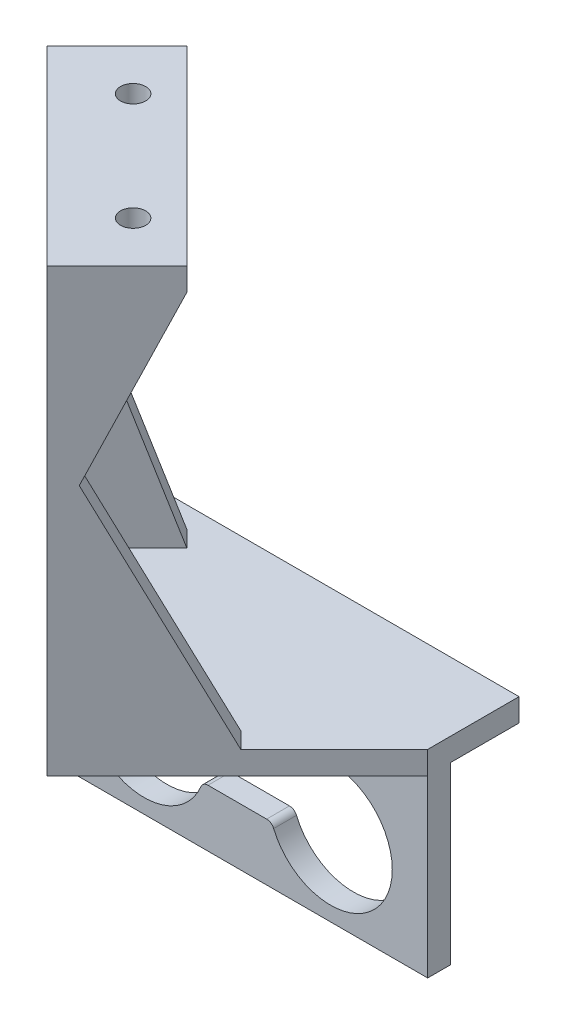
ISO-10303-21;
HEADER;
FILE_DESCRIPTION(('STEP AP214'),'2;1');
FILE_NAME('part.step','',(''),(''),'','','');
FILE_SCHEMA(('AUTOMOTIVE_DESIGN { 1 0 10303 214 1 1 1 1 }'));
ENDSEC;
DATA;
#1=APPLICATION_CONTEXT('core data for automotive mechanical design processes');
#2=APPLICATION_PROTOCOL_DEFINITION('international standard','automotive_design',2000,#1);
#3=PRODUCT_CONTEXT('',#1,'mechanical');
#4=PRODUCT('Part','Part','',(#3));
#5=PRODUCT_RELATED_PRODUCT_CATEGORY('part','',(#4));
#6=PRODUCT_DEFINITION_FORMATION('','',#4);
#7=PRODUCT_DEFINITION_CONTEXT('part definition',#1,'design');
#8=PRODUCT_DEFINITION('design','',#6,#7);
#9=PRODUCT_DEFINITION_SHAPE('','',#8);
#10=(LENGTH_UNIT() NAMED_UNIT(*) SI_UNIT(.MILLI.,.METRE.));
#11=(NAMED_UNIT(*) PLANE_ANGLE_UNIT() SI_UNIT($,.RADIAN.));
#12=(NAMED_UNIT(*) SI_UNIT($,.STERADIAN.) SOLID_ANGLE_UNIT());
#13=UNCERTAINTY_MEASURE_WITH_UNIT(LENGTH_MEASURE(1.E-05),#10,'distance_accuracy_value','');
#14=(GEOMETRIC_REPRESENTATION_CONTEXT(3) GLOBAL_UNCERTAINTY_ASSIGNED_CONTEXT((#13)) GLOBAL_UNIT_ASSIGNED_CONTEXT((#10,
#11,#12)) REPRESENTATION_CONTEXT('',''));
#15=CARTESIAN_POINT('',(0.,0.,0.));
#16=DIRECTION('',(0.,0.,1.));
#17=DIRECTION('',(1.,0.,0.));
#18=AXIS2_PLACEMENT_3D('',#15,#16,#17);
#19=CARTESIAN_POINT('',(2.12132034355976,71.,22.8786796564402));
#20=DIRECTION('',(0.707106781186548,0.,-0.707106781186547));
#21=DIRECTION('',(0.707106781186547,0.,0.707106781186548));
#22=AXIS2_PLACEMENT_3D('',#19,#20,#21);
#23=PLANE('',#22);
#24=DIRECTION('',(0.707106781186547,0.,0.707106781186548));
#25=VECTOR('',#24,1.);
#26=CARTESIAN_POINT('',(1.23165366794353E-13,68.,20.7573593128806));
#27=LINE('',#26,#25);
#28=CARTESIAN_POINT('',(-20.7573593128806,68.,-1.30537941567255E-13));
#29=VERTEX_POINT('',#28);
#30=CARTESIAN_POINT('',(1.22506171873482E-13,68.,20.7573593128806));
#31=VERTEX_POINT('',#30);
#32=EDGE_CURVE('E261',#29,#31,#27,.T.);
#33=ORIENTED_EDGE('',*,*,#32,.T.);
#34=DIRECTION('',(0.,-1.,0.));
#35=VECTOR('',#34,1.);
#36=CARTESIAN_POINT('',(0.,0.,20.7573593128805));
#37=LINE('',#36,#35);
#38=CARTESIAN_POINT('',(0.,46.,20.7573593128805));
#39=VERTEX_POINT('',#38);
#40=EDGE_CURVE('E505',#31,#39,#37,.T.);
#41=ORIENTED_EDGE('',*,*,#40,.T.);
#42=DIRECTION('',(0.,-1.,0.));
#43=VECTOR('',#42,1.);
#44=CARTESIAN_POINT('',(0.,0.,20.7573593128805));
#45=LINE('',#44,#43);
#46=CARTESIAN_POINT('',(0.,16.,20.7573593128805));
#47=VERTEX_POINT('',#46);
#48=EDGE_CURVE('E510',#39,#47,#45,.T.);
#49=ORIENTED_EDGE('',*,*,#48,.T.);
#50=DIRECTION('',(-0.707106781186547,0.,-0.707106781186548));
#51=VECTOR('',#50,1.);
#52=CARTESIAN_POINT('',(2.12132034355977,16.,22.8786796564402));
#53=LINE('',#52,#51);
#54=CARTESIAN_POINT('',(-20.7573593128806,16.,-1.27502175484295E-13));
#55=VERTEX_POINT('',#54);
#56=EDGE_CURVE('E269',#47,#55,#53,.T.);
#57=ORIENTED_EDGE('',*,*,#56,.T.);
#58=DIRECTION('',(0.,1.,0.));
#59=VECTOR('',#58,1.);
#60=CARTESIAN_POINT('',(-20.7573593128806,0.,-1.22731685925359E-13));
#61=LINE('',#60,#59);
#62=CARTESIAN_POINT('',(-20.7573593128806,46.,-1.24032728532342E-13));
#63=VERTEX_POINT('',#62);
#64=EDGE_CURVE('E491',#55,#63,#61,.T.);
#65=ORIENTED_EDGE('',*,*,#64,.T.);
#66=DIRECTION('',(0.,1.,0.));
#67=VECTOR('',#66,1.);
#68=CARTESIAN_POINT('',(-20.7573593128806,0.,-1.22731685925359E-13));
#69=LINE('',#68,#67);
#70=EDGE_CURVE('E921',#63,#29,#69,.T.);
#71=ORIENTED_EDGE('',*,*,#70,.T.);
#72=EDGE_LOOP('',(#33,#41,#49,#57,#65,#71));
#73=FACE_BOUND('',#72,.T.);
#74=ADVANCED_FACE('F41',(#73),#23,.T.);
#75=CARTESIAN_POINT('',(7.0710678118656,68.,13.6862915010151));
#76=DIRECTION('',(0.,1.,0.));
#77=DIRECTION('',(-1.,0.,0.));
#78=AXIS2_PLACEMENT_3D('',#75,#76,#77);
#79=PLANE('',#78);
#80=CARTESIAN_POINT('',(0.227922061357971,68.,13.914213562373));
#81=DIRECTION('',(0.,1.,0.));
#82=DIRECTION('',(0.,0.,1.));
#83=AXIS2_PLACEMENT_3D('',#80,#81,#82);
#84=CIRCLE('',#83,1.65);
#85=CARTESIAN_POINT('',(0.227922061357971,68.,15.564213562373));
#86=VERTEX_POINT('',#85);
#87=EDGE_CURVE('E909',#86,#86,#84,.T.);
#88=ORIENTED_EDGE('',*,*,#87,.T.);
#89=EDGE_LOOP('',(#88));
#90=FACE_BOUND('',#89,.T.);
#91=CARTESIAN_POINT('',(-13.914213562373,68.,-0.227922061357981));
#92=DIRECTION('',(0.,1.,0.));
#93=DIRECTION('',(0.,0.,1.));
#94=AXIS2_PLACEMENT_3D('',#91,#92,#93);
#95=CIRCLE('',#94,1.65);
#96=CARTESIAN_POINT('',(-13.914213562373,68.,1.42207793864202));
#97=VERTEX_POINT('',#96);
#98=EDGE_CURVE('E915',#97,#97,#95,.T.);
#99=ORIENTED_EDGE('',*,*,#98,.T.);
#100=EDGE_LOOP('',(#99));
#101=FACE_BOUND('',#100,.T.);
#102=DIRECTION('',(0.707106781186549,0.,-0.707106781186547));
#103=VECTOR('',#102,1.);
#104=CARTESIAN_POINT('',(-10.3786796564403,68.,-10.3786796564404));
#105=LINE('',#104,#103);
#106=CARTESIAN_POINT('',(-13.6862915010151,68.,-7.0710678118656));
#107=VERTEX_POINT('',#106);
#108=EDGE_CURVE('E254',#29,#107,#105,.T.);
#109=ORIENTED_EDGE('',*,*,#108,.T.);
#110=DIRECTION('',(0.707106781186547,0.,0.707106781186548));
#111=VECTOR('',#110,1.);
#112=CARTESIAN_POINT('',(7.0710678118656,68.,13.6862915010151));
#113=LINE('',#112,#111);
#114=CARTESIAN_POINT('',(7.0710678118656,68.,13.6862915010151));
#115=VERTEX_POINT('',#114);
#116=EDGE_CURVE('E246',#107,#115,#113,.T.);
#117=ORIENTED_EDGE('',*,*,#116,.T.);
#118=DIRECTION('',(-0.707106781186548,0.,0.707106781186547));
#119=VECTOR('',#118,1.);
#120=CARTESIAN_POINT('',(7.0710678118656,68.,13.6862915010151));
#121=LINE('',#120,#119);
#122=EDGE_CURVE('E249',#115,#31,#121,.T.);
#123=ORIENTED_EDGE('',*,*,#122,.T.);
#124=ORIENTED_EDGE('',*,*,#32,.F.);
#125=EDGE_LOOP('',(#109,#117,#123,#124));
#126=FACE_BOUND('',#125,.T.);
#127=ADVANCED_FACE('F544',(#90,#101,#126),#79,.F.);
#128=CARTESIAN_POINT('',(0.,16.,0.));
#129=DIRECTION('',(0.,1.,0.));
#130=DIRECTION('',(-1.,0.,0.));
#131=AXIS2_PLACEMENT_3D('',#128,#129,#130);
#132=PLANE('',#131);
#133=ORIENTED_EDGE('',*,*,#56,.F.);
#134=DIRECTION('',(0.707106781186551,0.,-0.707106781186544));
#135=VECTOR('',#134,1.);
#136=CARTESIAN_POINT('',(10.3786796564402,16.,10.3786796564403));
#137=LINE('',#136,#135);
#138=CARTESIAN_POINT('',(10.6066017177983,16.,10.1507575950823));
#139=VERTEX_POINT('',#138);
#140=EDGE_CURVE('E515',#47,#139,#137,.T.);
#141=ORIENTED_EDGE('',*,*,#140,.T.);
#142=DIRECTION('',(0.707106781186544,0.,0.707106781186551));
#143=VECTOR('',#142,1.);
#144=CARTESIAN_POINT('',(10.6066017177983,16.,10.1507575950823));
#145=LINE('',#144,#143);
#146=CARTESIAN_POINT('',(12.7279220613579,16.,12.272077938642));
#147=VERTEX_POINT('',#146);
#148=EDGE_CURVE('E267',#139,#147,#145,.T.);
#149=ORIENTED_EDGE('',*,*,#148,.T.);
#150=DIRECTION('',(-0.707106781186551,0.,0.707106781186544));
#151=VECTOR('',#150,1.);
#152=CARTESIAN_POINT('',(25.,16.,0.));
#153=LINE('',#152,#151);
#154=CARTESIAN_POINT('',(25.,16.,0.));
#155=VERTEX_POINT('',#154);
#156=EDGE_CURVE('E284',#155,#147,#153,.T.);
#157=ORIENTED_EDGE('',*,*,#156,.F.);
#158=DIRECTION('',(0.,0.,1.));
#159=VECTOR('',#158,1.);
#160=CARTESIAN_POINT('',(25.,16.,0.));
#161=LINE('',#160,#159);
#162=CARTESIAN_POINT('',(25.,16.,-12.));
#163=VERTEX_POINT('',#162);
#164=EDGE_CURVE('E315',#163,#155,#161,.T.);
#165=ORIENTED_EDGE('',*,*,#164,.F.);
#166=DIRECTION('',(1.,0.,0.));
#167=VECTOR('',#166,1.);
#168=CARTESIAN_POINT('',(-25.,16.,-12.));
#169=LINE('',#168,#167);
#170=CARTESIAN_POINT('',(-25.,16.,-12.));
#171=VERTEX_POINT('',#170);
#172=EDGE_CURVE('E312',#171,#163,#169,.T.);
#173=ORIENTED_EDGE('',*,*,#172,.F.);
#174=DIRECTION('',(0.,0.,-1.));
#175=VECTOR('',#174,1.);
#176=CARTESIAN_POINT('',(-25.,16.,0.));
#177=LINE('',#176,#175);
#178=CARTESIAN_POINT('',(-25.,16.,0.));
#179=VERTEX_POINT('',#178);
#180=EDGE_CURVE('E309',#179,#171,#177,.T.);
#181=ORIENTED_EDGE('',*,*,#180,.F.);
#182=DIRECTION('',(0.707106781186549,0.,-0.707106781186546));
#183=VECTOR('',#182,1.);
#184=CARTESIAN_POINT('',(-25.,16.,0.));
#185=LINE('',#184,#183);
#186=CARTESIAN_POINT('',(-15.8076118445747,16.,-9.19238815542524));
#187=VERTEX_POINT('',#186);
#188=EDGE_CURVE('E273',#179,#187,#185,.T.);
#189=ORIENTED_EDGE('',*,*,#188,.T.);
#190=DIRECTION('',(-0.707106781186546,0.,-0.707106781186548));
#191=VECTOR('',#190,1.);
#192=CARTESIAN_POINT('',(-13.6862915010151,16.,-7.07106781186559));
#193=LINE('',#192,#191);
#194=CARTESIAN_POINT('',(-13.6862915010151,16.,-7.0710678118656));
#195=VERTEX_POINT('',#194);
#196=EDGE_CURVE('E488',#195,#187,#193,.T.);
#197=ORIENTED_EDGE('',*,*,#196,.F.);
#198=DIRECTION('',(0.707106781186549,0.,-0.707106781186547));
#199=VECTOR('',#198,1.);
#200=CARTESIAN_POINT('',(-10.3786796564403,16.,-10.3786796564404));
#201=LINE('',#200,#199);
#202=EDGE_CURVE('E489',#55,#195,#201,.T.);
#203=ORIENTED_EDGE('',*,*,#202,.F.);
#204=EDGE_LOOP('',(#133,#141,#149,#157,#165,#173,#181,#189,#197,#203));
#205=FACE_BOUND('',#204,.T.);
#206=ADVANCED_FACE('F470',(#205),#132,.T.);
#207=CARTESIAN_POINT('',(-25.,16.,-12.));
#208=DIRECTION('',(0.,0.,1.));
#209=DIRECTION('',(-1.,0.,0.));
#210=AXIS2_PLACEMENT_3D('',#207,#208,#209);
#211=PLANE('',#210);
#212=DIRECTION('',(-1.,0.,0.));
#213=VECTOR('',#212,1.);
#214=CARTESIAN_POINT('',(25.,13.,-12.));
#215=LINE('',#214,#213);
#216=CARTESIAN_POINT('',(25.,13.,-12.));
#217=VERTEX_POINT('',#216);
#218=CARTESIAN_POINT('',(-25.,13.,-12.));
#219=VERTEX_POINT('',#218);
#220=EDGE_CURVE('E301',#217,#219,#215,.T.);
#221=ORIENTED_EDGE('',*,*,#220,.T.);
#222=DIRECTION('',(0.,-1.,0.));
#223=VECTOR('',#222,1.);
#224=CARTESIAN_POINT('',(-25.,16.,-12.));
#225=LINE('',#224,#223);
#226=EDGE_CURVE('E321',#171,#219,#225,.T.);
#227=ORIENTED_EDGE('',*,*,#226,.F.);
#228=ORIENTED_EDGE('',*,*,#172,.T.);
#229=DIRECTION('',(0.,-1.,0.));
#230=VECTOR('',#229,1.);
#231=CARTESIAN_POINT('',(25.,16.,-12.));
#232=LINE('',#231,#230);
#233=EDGE_CURVE('E318',#163,#217,#232,.T.);
#234=ORIENTED_EDGE('',*,*,#233,.T.);
#235=EDGE_LOOP('',(#221,#227,#228,#234));
#236=FACE_BOUND('',#235,.T.);
#237=ADVANCED_FACE('F463',(#236),#211,.F.);
#238=CARTESIAN_POINT('',(0.,0.,-3.));
#239=DIRECTION('',(0.,0.,-1.));
#240=DIRECTION('',(1.,0.,0.));
#241=AXIS2_PLACEMENT_3D('',#238,#239,#240);
#242=PLANE('',#241);
#243=DIRECTION('',(0.,-1.,0.));
#244=VECTOR('',#243,1.);
#245=CARTESIAN_POINT('',(-25.,-10.,-3.));
#246=LINE('',#245,#244);
#247=CARTESIAN_POINT('',(-25.,13.,-3.));
#248=VERTEX_POINT('',#247);
#249=CARTESIAN_POINT('',(-25.,-10.,-3.));
#250=VERTEX_POINT('',#249);
#251=EDGE_CURVE('E421',#248,#250,#246,.T.);
#252=ORIENTED_EDGE('',*,*,#251,.F.);
#253=DIRECTION('',(1.,0.,0.));
#254=VECTOR('',#253,1.);
#255=CARTESIAN_POINT('',(25.,13.,-3.));
#256=LINE('',#255,#254);
#257=CARTESIAN_POINT('',(25.,13.,-3.));
#258=VERTEX_POINT('',#257);
#259=EDGE_CURVE('E306',#248,#258,#256,.T.);
#260=ORIENTED_EDGE('',*,*,#259,.T.);
#261=DIRECTION('',(0.,1.,0.));
#262=VECTOR('',#261,1.);
#263=CARTESIAN_POINT('',(25.,-10.,-3.));
#264=LINE('',#263,#262);
#265=CARTESIAN_POINT('',(25.,-10.,-3.));
#266=VERTEX_POINT('',#265);
#267=EDGE_CURVE('E428',#266,#258,#264,.T.);
#268=ORIENTED_EDGE('',*,*,#267,.F.);
#269=DIRECTION('',(1.,0.,0.));
#270=VECTOR('',#269,1.);
#271=CARTESIAN_POINT('',(25.,-10.,-3.));
#272=LINE('',#271,#270);
#273=EDGE_CURVE('E424',#250,#266,#272,.T.);
#274=ORIENTED_EDGE('',*,*,#273,.F.);
#275=EDGE_LOOP('',(#252,#260,#268,#274));
#276=FACE_BOUND('',#275,.T.);
#277=CARTESIAN_POINT('',(12.25,0.,-3.));
#278=DIRECTION('',(0.,0.,1.));
#279=DIRECTION('',(1.,0.,0.));
#280=AXIS2_PLACEMENT_3D('',#277,#278,#279);
#281=CIRCLE('',#280,8.1);
#282=CARTESIAN_POINT('',(4.77307692307692,-3.11538461538461,-3.));
#283=VERTEX_POINT('',#282);
#284=CARTESIAN_POINT('',(4.77307692307692,3.11538461538462,-3.));
#285=VERTEX_POINT('',#284);
#286=EDGE_CURVE('E360',#283,#285,#281,.T.);
#287=ORIENTED_EDGE('',*,*,#286,.T.);
#288=CARTESIAN_POINT('',(3.85,3.5,-3.));
#289=DIRECTION('',(0.,0.,-1.));
#290=DIRECTION('',(1.,0.,0.));
#291=AXIS2_PLACEMENT_3D('',#288,#289,#290);
#292=CIRCLE('',#291,1.);
#293=CARTESIAN_POINT('',(3.85,2.5,-3.));
#294=VERTEX_POINT('',#293);
#295=EDGE_CURVE('E364',#285,#294,#292,.T.);
#296=ORIENTED_EDGE('',*,*,#295,.T.);
#297=DIRECTION('',(-1.,0.,0.));
#298=VECTOR('',#297,1.);
#299=CARTESIAN_POINT('',(-3.85,2.5,-3.));
#300=LINE('',#299,#298);
#301=CARTESIAN_POINT('',(-3.85,2.5,-3.));
#302=VERTEX_POINT('',#301);
#303=EDGE_CURVE('E367',#294,#302,#300,.T.);
#304=ORIENTED_EDGE('',*,*,#303,.T.);
#305=CARTESIAN_POINT('',(-3.85,3.5,-3.));
#306=DIRECTION('',(0.,0.,-1.));
#307=DIRECTION('',(-1.,0.,0.));
#308=AXIS2_PLACEMENT_3D('',#305,#306,#307);
#309=CIRCLE('',#308,1.);
#310=CARTESIAN_POINT('',(-4.77307692307692,3.11538461538461,-3.));
#311=VERTEX_POINT('',#310);
#312=EDGE_CURVE('E370',#302,#311,#309,.T.);
#313=ORIENTED_EDGE('',*,*,#312,.T.);
#314=CARTESIAN_POINT('',(-12.25,0.,-3.));
#315=DIRECTION('',(0.,0.,1.));
#316=DIRECTION('',(1.,0.,0.));
#317=AXIS2_PLACEMENT_3D('',#314,#315,#316);
#318=CIRCLE('',#317,8.1);
#319=CARTESIAN_POINT('',(-4.77307692307692,-3.11538461538462,-3.));
#320=VERTEX_POINT('',#319);
#321=EDGE_CURVE('E373',#311,#320,#318,.T.);
#322=ORIENTED_EDGE('',*,*,#321,.T.);
#323=CARTESIAN_POINT('',(-3.85,-3.5,-3.));
#324=DIRECTION('',(0.,0.,-1.));
#325=DIRECTION('',(1.,0.,0.));
#326=AXIS2_PLACEMENT_3D('',#323,#324,#325);
#327=CIRCLE('',#326,1.);
#328=CARTESIAN_POINT('',(-3.85,-2.5,-3.));
#329=VERTEX_POINT('',#328);
#330=EDGE_CURVE('E376',#320,#329,#327,.T.);
#331=ORIENTED_EDGE('',*,*,#330,.T.);
#332=DIRECTION('',(1.,0.,0.));
#333=VECTOR('',#332,1.);
#334=CARTESIAN_POINT('',(3.85,-2.5,-3.));
#335=LINE('',#334,#333);
#336=CARTESIAN_POINT('',(3.85,-2.5,-3.));
#337=VERTEX_POINT('',#336);
#338=EDGE_CURVE('E379',#329,#337,#335,.T.);
#339=ORIENTED_EDGE('',*,*,#338,.T.);
#340=CARTESIAN_POINT('',(3.85,-3.5,-3.));
#341=DIRECTION('',(0.,0.,-1.));
#342=DIRECTION('',(-1.,0.,0.));
#343=AXIS2_PLACEMENT_3D('',#340,#341,#342);
#344=CIRCLE('',#343,1.);
#345=EDGE_CURVE('E357',#337,#283,#344,.T.);
#346=ORIENTED_EDGE('',*,*,#345,.T.);
#347=EDGE_LOOP('',(#287,#296,#304,#313,#322,#331,#339,#346));
#348=FACE_BOUND('',#347,.T.);
#349=DIRECTION('',(-1.,0.,0.));
#350=VECTOR('',#349,1.);
#351=CARTESIAN_POINT('',(3.25,9.,-3.));
#352=LINE('',#351,#350);
#353=CARTESIAN_POINT('',(3.25,9.,-3.));
#354=VERTEX_POINT('',#353);
#355=CARTESIAN_POINT('',(-3.25,9.,-3.));
#356=VERTEX_POINT('',#355);
#357=EDGE_CURVE('E328',#354,#356,#352,.T.);
#358=ORIENTED_EDGE('',*,*,#357,.T.);
#359=CARTESIAN_POINT('',(-3.25,7.25,-3.));
#360=DIRECTION('',(0.,0.,1.));
#361=DIRECTION('',(1.,0.,0.));
#362=AXIS2_PLACEMENT_3D('',#359,#360,#361);
#363=CIRCLE('',#362,1.75);
#364=CARTESIAN_POINT('',(-3.25,5.5,-3.));
#365=VERTEX_POINT('',#364);
#366=EDGE_CURVE('E332',#356,#365,#363,.T.);
#367=ORIENTED_EDGE('',*,*,#366,.T.);
#368=DIRECTION('',(1.,0.,0.));
#369=VECTOR('',#368,1.);
#370=CARTESIAN_POINT('',(3.25,5.5,-3.));
#371=LINE('',#370,#369);
#372=CARTESIAN_POINT('',(3.25,5.5,-3.));
#373=VERTEX_POINT('',#372);
#374=EDGE_CURVE('E335',#365,#373,#371,.T.);
#375=ORIENTED_EDGE('',*,*,#374,.T.);
#376=CARTESIAN_POINT('',(3.25,7.25,-3.));
#377=DIRECTION('',(0.,0.,1.));
#378=DIRECTION('',(1.,0.,0.));
#379=AXIS2_PLACEMENT_3D('',#376,#377,#378);
#380=CIRCLE('',#379,1.75);
#381=EDGE_CURVE('E325',#373,#354,#380,.T.);
#382=ORIENTED_EDGE('',*,*,#381,.T.);
#383=EDGE_LOOP('',(#358,#367,#375,#382));
#384=FACE_BOUND('',#383,.T.);
#385=ADVANCED_FACE('F457',(#276,#348,#384),#242,.T.);
#386=CARTESIAN_POINT('',(0.,0.,0.));
#387=DIRECTION('',(0.,0.,-1.));
#388=DIRECTION('',(1.,0.,0.));
#389=AXIS2_PLACEMENT_3D('',#386,#387,#388);
#390=PLANE('',#389);
#391=CARTESIAN_POINT('',(3.85,-3.5,0.));
#392=DIRECTION('',(0.,0.,-1.));
#393=DIRECTION('',(-1.,0.,0.));
#394=AXIS2_PLACEMENT_3D('',#391,#392,#393);
#395=CIRCLE('',#394,1.);
#396=CARTESIAN_POINT('',(3.85,-2.5,0.));
#397=VERTEX_POINT('',#396);
#398=CARTESIAN_POINT('',(4.77307692307692,-3.11538461538461,0.));
#399=VERTEX_POINT('',#398);
#400=EDGE_CURVE('E356',#397,#399,#395,.T.);
#401=ORIENTED_EDGE('',*,*,#400,.F.);
#402=DIRECTION('',(1.,0.,0.));
#403=VECTOR('',#402,1.);
#404=CARTESIAN_POINT('',(3.85,-2.5,0.));
#405=LINE('',#404,#403);
#406=CARTESIAN_POINT('',(-3.85,-2.5,0.));
#407=VERTEX_POINT('',#406);
#408=EDGE_CURVE('E361',#407,#397,#405,.T.);
#409=ORIENTED_EDGE('',*,*,#408,.F.);
#410=CARTESIAN_POINT('',(-3.85,-3.5,0.));
#411=DIRECTION('',(0.,0.,-1.));
#412=DIRECTION('',(1.,0.,0.));
#413=AXIS2_PLACEMENT_3D('',#410,#411,#412);
#414=CIRCLE('',#413,1.);
#415=CARTESIAN_POINT('',(-4.77307692307692,-3.11538461538462,0.));
#416=VERTEX_POINT('',#415);
#417=EDGE_CURVE('E400',#416,#407,#414,.T.);
#418=ORIENTED_EDGE('',*,*,#417,.F.);
#419=CARTESIAN_POINT('',(-12.25,0.,0.));
#420=DIRECTION('',(0.,0.,1.));
#421=DIRECTION('',(1.,0.,0.));
#422=AXIS2_PLACEMENT_3D('',#419,#420,#421);
#423=CIRCLE('',#422,8.1);
#424=CARTESIAN_POINT('',(-4.77307692307692,3.11538461538461,0.));
#425=VERTEX_POINT('',#424);
#426=EDGE_CURVE('E397',#425,#416,#423,.T.);
#427=ORIENTED_EDGE('',*,*,#426,.F.);
#428=CARTESIAN_POINT('',(-3.85,3.5,0.));
#429=DIRECTION('',(0.,0.,-1.));
#430=DIRECTION('',(-1.,0.,0.));
#431=AXIS2_PLACEMENT_3D('',#428,#429,#430);
#432=CIRCLE('',#431,1.);
#433=CARTESIAN_POINT('',(-3.85,2.5,0.));
#434=VERTEX_POINT('',#433);
#435=EDGE_CURVE('E394',#434,#425,#432,.T.);
#436=ORIENTED_EDGE('',*,*,#435,.F.);
#437=DIRECTION('',(-1.,0.,0.));
#438=VECTOR('',#437,1.);
#439=CARTESIAN_POINT('',(-3.85,2.5,0.));
#440=LINE('',#439,#438);
#441=CARTESIAN_POINT('',(3.85,2.5,0.));
#442=VERTEX_POINT('',#441);
#443=EDGE_CURVE('E391',#442,#434,#440,.T.);
#444=ORIENTED_EDGE('',*,*,#443,.F.);
#445=CARTESIAN_POINT('',(3.85,3.5,0.));
#446=DIRECTION('',(0.,0.,-1.));
#447=DIRECTION('',(1.,0.,0.));
#448=AXIS2_PLACEMENT_3D('',#445,#446,#447);
#449=CIRCLE('',#448,1.);
#450=CARTESIAN_POINT('',(4.77307692307692,3.11538461538462,0.));
#451=VERTEX_POINT('',#450);
#452=EDGE_CURVE('E388',#451,#442,#449,.T.);
#453=ORIENTED_EDGE('',*,*,#452,.F.);
#454=CARTESIAN_POINT('',(12.25,0.,0.));
#455=DIRECTION('',(0.,0.,1.));
#456=DIRECTION('',(1.,0.,0.));
#457=AXIS2_PLACEMENT_3D('',#454,#455,#456);
#458=CIRCLE('',#457,8.1);
#459=EDGE_CURVE('E385',#399,#451,#458,.T.);
#460=ORIENTED_EDGE('',*,*,#459,.F.);
#461=EDGE_LOOP('',(#401,#409,#418,#427,#436,#444,#453,#460));
#462=FACE_BOUND('',#461,.T.);
#463=DIRECTION('',(0.,-1.,0.));
#464=VECTOR('',#463,1.);
#465=CARTESIAN_POINT('',(-25.,-10.,0.));
#466=LINE('',#465,#464);
#467=CARTESIAN_POINT('',(-25.,13.,0.));
#468=VERTEX_POINT('',#467);
#469=CARTESIAN_POINT('',(-25.,-10.,0.));
#470=VERTEX_POINT('',#469);
#471=EDGE_CURVE('E420',#468,#470,#466,.T.);
#472=ORIENTED_EDGE('',*,*,#471,.T.);
#473=DIRECTION('',(1.,0.,0.));
#474=VECTOR('',#473,1.);
#475=CARTESIAN_POINT('',(25.,-10.,0.));
#476=LINE('',#475,#474);
#477=CARTESIAN_POINT('',(25.,-10.,0.));
#478=VERTEX_POINT('',#477);
#479=EDGE_CURVE('E434',#470,#478,#476,.T.);
#480=ORIENTED_EDGE('',*,*,#479,.T.);
#481=DIRECTION('',(0.,1.,0.));
#482=VECTOR('',#481,1.);
#483=CARTESIAN_POINT('',(25.,-10.,0.));
#484=LINE('',#483,#482);
#485=CARTESIAN_POINT('',(25.,13.,0.));
#486=VERTEX_POINT('',#485);
#487=EDGE_CURVE('E425',#478,#486,#484,.T.);
#488=ORIENTED_EDGE('',*,*,#487,.T.);
#489=DIRECTION('',(1.,0.,0.));
#490=VECTOR('',#489,1.);
#491=CARTESIAN_POINT('',(25.,13.,0.));
#492=LINE('',#491,#490);
#493=EDGE_CURVE('E285',#468,#486,#492,.T.);
#494=ORIENTED_EDGE('',*,*,#493,.F.);
#495=EDGE_LOOP('',(#472,#480,#488,#494));
#496=FACE_BOUND('',#495,.T.);
#497=CARTESIAN_POINT('',(3.25,7.25,0.));
#498=DIRECTION('',(0.,0.,1.));
#499=DIRECTION('',(1.,0.,0.));
#500=AXIS2_PLACEMENT_3D('',#497,#498,#499);
#501=CIRCLE('',#500,1.75);
#502=CARTESIAN_POINT('',(3.25,5.5,0.));
#503=VERTEX_POINT('',#502);
#504=CARTESIAN_POINT('',(3.25,9.,0.));
#505=VERTEX_POINT('',#504);
#506=EDGE_CURVE('E324',#503,#505,#501,.T.);
#507=ORIENTED_EDGE('',*,*,#506,.F.);
#508=DIRECTION('',(1.,0.,0.));
#509=VECTOR('',#508,1.);
#510=CARTESIAN_POINT('',(3.25,5.5,0.));
#511=LINE('',#510,#509);
#512=CARTESIAN_POINT('',(-3.25,5.5,0.));
#513=VERTEX_POINT('',#512);
#514=EDGE_CURVE('E329',#513,#503,#511,.T.);
#515=ORIENTED_EDGE('',*,*,#514,.F.);
#516=CARTESIAN_POINT('',(-3.25,7.25,0.));
#517=DIRECTION('',(0.,0.,1.));
#518=DIRECTION('',(1.,0.,0.));
#519=AXIS2_PLACEMENT_3D('',#516,#517,#518);
#520=CIRCLE('',#519,1.75);
#521=CARTESIAN_POINT('',(-3.25,9.,0.));
#522=VERTEX_POINT('',#521);
#523=EDGE_CURVE('E344',#522,#513,#520,.T.);
#524=ORIENTED_EDGE('',*,*,#523,.F.);
#525=DIRECTION('',(-1.,0.,0.));
#526=VECTOR('',#525,1.);
#527=CARTESIAN_POINT('',(3.25,9.,0.));
#528=LINE('',#527,#526);
#529=EDGE_CURVE('E341',#505,#522,#528,.T.);
#530=ORIENTED_EDGE('',*,*,#529,.F.);
#531=EDGE_LOOP('',(#507,#515,#524,#530));
#532=FACE_BOUND('',#531,.T.);
#533=ADVANCED_FACE('F450',(#462,#496,#532),#390,.F.);
#534=CARTESIAN_POINT('',(-25.,-10.,-3.));
#535=DIRECTION('',(1.,0.,0.));
#536=DIRECTION('',(0.,0.,1.));
#537=AXIS2_PLACEMENT_3D('',#534,#535,#536);
#538=PLANE('',#537);
#539=ORIENTED_EDGE('',*,*,#251,.T.);
#540=DIRECTION('',(0.,0.,1.));
#541=VECTOR('',#540,1.);
#542=CARTESIAN_POINT('',(-25.,-10.,-3.));
#543=LINE('',#542,#541);
#544=EDGE_CURVE('E11',#250,#470,#543,.T.);
#545=ORIENTED_EDGE('',*,*,#544,.T.);
#546=ORIENTED_EDGE('',*,*,#471,.F.);
#547=EDGE_CURVE('E431',#179,#468,#466,.T.);
#548=ORIENTED_EDGE('',*,*,#547,.F.);
#549=ORIENTED_EDGE('',*,*,#180,.T.);
#550=ORIENTED_EDGE('',*,*,#226,.T.);
#551=DIRECTION('',(0.,0.,1.));
#552=VECTOR('',#551,1.);
#553=CARTESIAN_POINT('',(-25.,13.,-3.));
#554=LINE('',#553,#552);
#555=EDGE_CURVE('E304',#219,#248,#554,.T.);
#556=ORIENTED_EDGE('',*,*,#555,.T.);
#557=EDGE_LOOP('',(#539,#545,#546,#548,#549,#550,#556));
#558=FACE_BOUND('',#557,.T.);
#559=ADVANCED_FACE('F43',(#558),#538,.F.);
#560=CARTESIAN_POINT('',(25.,-10.,-3.));
#561=DIRECTION('',(0.,1.,0.));
#562=DIRECTION('',(-1.,0.,0.));
#563=AXIS2_PLACEMENT_3D('',#560,#561,#562);
#564=PLANE('',#563);
#565=ORIENTED_EDGE('',*,*,#479,.F.);
#566=ORIENTED_EDGE('',*,*,#544,.F.);
#567=ORIENTED_EDGE('',*,*,#273,.T.);
#568=DIRECTION('',(0.,0.,1.));
#569=VECTOR('',#568,1.);
#570=CARTESIAN_POINT('',(25.,-10.,-3.));
#571=LINE('',#570,#569);
#572=EDGE_CURVE('E49',#266,#478,#571,.T.);
#573=ORIENTED_EDGE('',*,*,#572,.T.);
#574=EDGE_LOOP('',(#565,#566,#567,#573));
#575=FACE_BOUND('',#574,.T.);
#576=ADVANCED_FACE('F441',(#575),#564,.F.);
#577=CARTESIAN_POINT('',(25.,-10.,-3.));
#578=DIRECTION('',(-1.,0.,0.));
#579=DIRECTION('',(0.,0.,-1.));
#580=AXIS2_PLACEMENT_3D('',#577,#578,#579);
#581=PLANE('',#580);
#582=DIRECTION('',(0.,0.,-1.));
#583=VECTOR('',#582,1.);
#584=CARTESIAN_POINT('',(25.,13.,-3.));
#585=LINE('',#584,#583);
#586=EDGE_CURVE('E298',#258,#217,#585,.T.);
#587=ORIENTED_EDGE('',*,*,#586,.T.);
#588=ORIENTED_EDGE('',*,*,#233,.F.);
#589=ORIENTED_EDGE('',*,*,#164,.T.);
#590=DIRECTION('',(0.,1.,0.));
#591=VECTOR('',#590,1.);
#592=CARTESIAN_POINT('',(25.,13.,0.));
#593=LINE('',#592,#591);
#594=EDGE_CURVE('E292',#486,#155,#593,.T.);
#595=ORIENTED_EDGE('',*,*,#594,.F.);
#596=ORIENTED_EDGE('',*,*,#487,.F.);
#597=ORIENTED_EDGE('',*,*,#572,.F.);
#598=ORIENTED_EDGE('',*,*,#267,.T.);
#599=EDGE_LOOP('',(#587,#588,#589,#595,#596,#597,#598));
#600=FACE_BOUND('',#599,.T.);
#601=ADVANCED_FACE('F447',(#600),#581,.F.);
#602=CARTESIAN_POINT('',(3.85,-3.5,-3.));
#603=DIRECTION('',(0.,0.,1.));
#604=DIRECTION('',(-1.,0.,0.));
#605=AXIS2_PLACEMENT_3D('',#602,#603,#604);
#606=CYLINDRICAL_SURFACE('',#605,1.);
#607=ORIENTED_EDGE('',*,*,#400,.T.);
#608=DIRECTION('',(0.,0.,1.));
#609=VECTOR('',#608,1.);
#610=CARTESIAN_POINT('',(4.77307692307692,-3.11538461538461,-3.));
#611=LINE('',#610,#609);
#612=EDGE_CURVE('E418',#283,#399,#611,.T.);
#613=ORIENTED_EDGE('',*,*,#612,.F.);
#614=ORIENTED_EDGE('',*,*,#345,.F.);
#615=DIRECTION('',(0.,0.,1.));
#616=VECTOR('',#615,1.);
#617=CARTESIAN_POINT('',(3.85,-2.5,-3.));
#618=LINE('',#617,#616);
#619=EDGE_CURVE('E382',#337,#397,#618,.T.);
#620=ORIENTED_EDGE('',*,*,#619,.T.);
#621=EDGE_LOOP('',(#607,#613,#614,#620));
#622=FACE_BOUND('',#621,.T.);
#623=ADVANCED_FACE('F607',(#622),#606,.T.);
#624=CARTESIAN_POINT('',(12.25,0.,-3.));
#625=DIRECTION('',(0.,0.,1.));
#626=DIRECTION('',(-1.,0.,0.));
#627=AXIS2_PLACEMENT_3D('',#624,#625,#626);
#628=CYLINDRICAL_SURFACE('',#627,8.1);
#629=ORIENTED_EDGE('',*,*,#459,.T.);
#630=DIRECTION('',(0.,0.,1.));
#631=VECTOR('',#630,1.);
#632=CARTESIAN_POINT('',(4.77307692307692,3.11538461538462,-3.));
#633=LINE('',#632,#631);
#634=EDGE_CURVE('E416',#285,#451,#633,.T.);
#635=ORIENTED_EDGE('',*,*,#634,.F.);
#636=ORIENTED_EDGE('',*,*,#286,.F.);
#637=ORIENTED_EDGE('',*,*,#612,.T.);
#638=EDGE_LOOP('',(#629,#635,#636,#637));
#639=FACE_BOUND('',#638,.T.);
#640=ADVANCED_FACE('F603',(#639),#628,.F.);
#641=CARTESIAN_POINT('',(3.85,3.5,-3.));
#642=DIRECTION('',(0.,0.,1.));
#643=DIRECTION('',(-1.,0.,0.));
#644=AXIS2_PLACEMENT_3D('',#641,#642,#643);
#645=CYLINDRICAL_SURFACE('',#644,1.);
#646=ORIENTED_EDGE('',*,*,#452,.T.);
#647=DIRECTION('',(0.,0.,1.));
#648=VECTOR('',#647,1.);
#649=CARTESIAN_POINT('',(3.85,2.5,-3.));
#650=LINE('',#649,#648);
#651=EDGE_CURVE('E414',#294,#442,#650,.T.);
#652=ORIENTED_EDGE('',*,*,#651,.F.);
#653=ORIENTED_EDGE('',*,*,#295,.F.);
#654=ORIENTED_EDGE('',*,*,#634,.T.);
#655=EDGE_LOOP('',(#646,#652,#653,#654));
#656=FACE_BOUND('',#655,.T.);
#657=ADVANCED_FACE('F599',(#656),#645,.T.);
#658=CARTESIAN_POINT('',(-3.85,2.5,-3.));
#659=DIRECTION('',(0.,-1.,0.));
#660=DIRECTION('',(0.,0.,1.));
#661=AXIS2_PLACEMENT_3D('',#658,#659,#660);
#662=PLANE('',#661);
#663=ORIENTED_EDGE('',*,*,#443,.T.);
#664=DIRECTION('',(0.,0.,1.));
#665=VECTOR('',#664,1.);
#666=CARTESIAN_POINT('',(-3.85,2.5,-3.));
#667=LINE('',#666,#665);
#668=EDGE_CURVE('E412',#302,#434,#667,.T.);
#669=ORIENTED_EDGE('',*,*,#668,.F.);
#670=ORIENTED_EDGE('',*,*,#303,.F.);
#671=ORIENTED_EDGE('',*,*,#651,.T.);
#672=EDGE_LOOP('',(#663,#669,#670,#671));
#673=FACE_BOUND('',#672,.T.);
#674=ADVANCED_FACE('F595',(#673),#662,.T.);
#675=CARTESIAN_POINT('',(-3.85,3.5,-3.));
#676=DIRECTION('',(0.,0.,1.));
#677=DIRECTION('',(-1.,0.,0.));
#678=AXIS2_PLACEMENT_3D('',#675,#676,#677);
#679=CYLINDRICAL_SURFACE('',#678,1.);
#680=ORIENTED_EDGE('',*,*,#435,.T.);
#681=DIRECTION('',(0.,0.,1.));
#682=VECTOR('',#681,1.);
#683=CARTESIAN_POINT('',(-4.77307692307692,3.11538461538461,-3.));
#684=LINE('',#683,#682);
#685=EDGE_CURVE('E410',#311,#425,#684,.T.);
#686=ORIENTED_EDGE('',*,*,#685,.F.);
#687=ORIENTED_EDGE('',*,*,#312,.F.);
#688=ORIENTED_EDGE('',*,*,#668,.T.);
#689=EDGE_LOOP('',(#680,#686,#687,#688));
#690=FACE_BOUND('',#689,.T.);
#691=ADVANCED_FACE('F591',(#690),#679,.T.);
#692=CARTESIAN_POINT('',(-12.25,0.,-3.));
#693=DIRECTION('',(0.,0.,1.));
#694=DIRECTION('',(-1.,0.,0.));
#695=AXIS2_PLACEMENT_3D('',#692,#693,#694);
#696=CYLINDRICAL_SURFACE('',#695,8.1);
#697=ORIENTED_EDGE('',*,*,#426,.T.);
#698=DIRECTION('',(0.,0.,1.));
#699=VECTOR('',#698,1.);
#700=CARTESIAN_POINT('',(-4.77307692307692,-3.11538461538462,-3.));
#701=LINE('',#700,#699);
#702=EDGE_CURVE('E408',#320,#416,#701,.T.);
#703=ORIENTED_EDGE('',*,*,#702,.F.);
#704=ORIENTED_EDGE('',*,*,#321,.F.);
#705=ORIENTED_EDGE('',*,*,#685,.T.);
#706=EDGE_LOOP('',(#697,#703,#704,#705));
#707=FACE_BOUND('',#706,.T.);
#708=ADVANCED_FACE('F587',(#707),#696,.F.);
#709=CARTESIAN_POINT('',(-3.85,-3.5,-3.));
#710=DIRECTION('',(0.,0.,1.));
#711=DIRECTION('',(-1.,0.,0.));
#712=AXIS2_PLACEMENT_3D('',#709,#710,#711);
#713=CYLINDRICAL_SURFACE('',#712,1.);
#714=ORIENTED_EDGE('',*,*,#417,.T.);
#715=DIRECTION('',(0.,0.,1.));
#716=VECTOR('',#715,1.);
#717=CARTESIAN_POINT('',(-3.85,-2.5,-3.));
#718=LINE('',#717,#716);
#719=EDGE_CURVE('E406',#329,#407,#718,.T.);
#720=ORIENTED_EDGE('',*,*,#719,.F.);
#721=ORIENTED_EDGE('',*,*,#330,.F.);
#722=ORIENTED_EDGE('',*,*,#702,.T.);
#723=EDGE_LOOP('',(#714,#720,#721,#722));
#724=FACE_BOUND('',#723,.T.);
#725=ADVANCED_FACE('F583',(#724),#713,.T.);
#726=CARTESIAN_POINT('',(3.85,-2.5,-3.));
#727=DIRECTION('',(0.,1.,0.));
#728=DIRECTION('',(-1.,0.,0.));
#729=AXIS2_PLACEMENT_3D('',#726,#727,#728);
#730=PLANE('',#729);
#731=ORIENTED_EDGE('',*,*,#408,.T.);
#732=ORIENTED_EDGE('',*,*,#619,.F.);
#733=ORIENTED_EDGE('',*,*,#338,.F.);
#734=ORIENTED_EDGE('',*,*,#719,.T.);
#735=EDGE_LOOP('',(#731,#732,#733,#734));
#736=FACE_BOUND('',#735,.T.);
#737=ADVANCED_FACE('F579',(#736),#730,.T.);
#738=CARTESIAN_POINT('',(3.25,7.25,-3.));
#739=DIRECTION('',(0.,0.,1.));
#740=DIRECTION('',(-1.,0.,0.));
#741=AXIS2_PLACEMENT_3D('',#738,#739,#740);
#742=CYLINDRICAL_SURFACE('',#741,1.75);
#743=ORIENTED_EDGE('',*,*,#506,.T.);
#744=DIRECTION('',(0.,0.,1.));
#745=VECTOR('',#744,1.);
#746=CARTESIAN_POINT('',(3.25,9.,-3.));
#747=LINE('',#746,#745);
#748=EDGE_CURVE('E354',#354,#505,#747,.T.);
#749=ORIENTED_EDGE('',*,*,#748,.F.);
#750=ORIENTED_EDGE('',*,*,#381,.F.);
#751=DIRECTION('',(0.,0.,1.));
#752=VECTOR('',#751,1.);
#753=CARTESIAN_POINT('',(3.25,5.5,-3.));
#754=LINE('',#753,#752);
#755=EDGE_CURVE('E338',#373,#503,#754,.T.);
#756=ORIENTED_EDGE('',*,*,#755,.T.);
#757=EDGE_LOOP('',(#743,#749,#750,#756));
#758=FACE_BOUND('',#757,.T.);
#759=ADVANCED_FACE('F575',(#758),#742,.F.);
#760=CARTESIAN_POINT('',(3.25,9.,-3.));
#761=DIRECTION('',(0.,-1.,0.));
#762=DIRECTION('',(1.,0.,0.));
#763=AXIS2_PLACEMENT_3D('',#760,#761,#762);
#764=PLANE('',#763);
#765=ORIENTED_EDGE('',*,*,#529,.T.);
#766=DIRECTION('',(0.,0.,1.));
#767=VECTOR('',#766,1.);
#768=CARTESIAN_POINT('',(-3.25,9.,-3.));
#769=LINE('',#768,#767);
#770=EDGE_CURVE('E352',#356,#522,#769,.T.);
#771=ORIENTED_EDGE('',*,*,#770,.F.);
#772=ORIENTED_EDGE('',*,*,#357,.F.);
#773=ORIENTED_EDGE('',*,*,#748,.T.);
#774=EDGE_LOOP('',(#765,#771,#772,#773));
#775=FACE_BOUND('',#774,.T.);
#776=ADVANCED_FACE('F571',(#775),#764,.T.);
#777=CARTESIAN_POINT('',(-3.25,7.25,-3.));
#778=DIRECTION('',(0.,0.,1.));
#779=DIRECTION('',(-1.,0.,0.));
#780=AXIS2_PLACEMENT_3D('',#777,#778,#779);
#781=CYLINDRICAL_SURFACE('',#780,1.75);
#782=ORIENTED_EDGE('',*,*,#523,.T.);
#783=DIRECTION('',(0.,0.,1.));
#784=VECTOR('',#783,1.);
#785=CARTESIAN_POINT('',(-3.25,5.5,-3.));
#786=LINE('',#785,#784);
#787=EDGE_CURVE('E350',#365,#513,#786,.T.);
#788=ORIENTED_EDGE('',*,*,#787,.F.);
#789=ORIENTED_EDGE('',*,*,#366,.F.);
#790=ORIENTED_EDGE('',*,*,#770,.T.);
#791=EDGE_LOOP('',(#782,#788,#789,#790));
#792=FACE_BOUND('',#791,.T.);
#793=ADVANCED_FACE('F567',(#792),#781,.F.);
#794=CARTESIAN_POINT('',(3.25,5.5,-3.));
#795=DIRECTION('',(0.,1.,0.));
#796=DIRECTION('',(0.,0.,-1.));
#797=AXIS2_PLACEMENT_3D('',#794,#795,#796);
#798=PLANE('',#797);
#799=ORIENTED_EDGE('',*,*,#514,.T.);
#800=ORIENTED_EDGE('',*,*,#755,.F.);
#801=ORIENTED_EDGE('',*,*,#374,.F.);
#802=ORIENTED_EDGE('',*,*,#787,.T.);
#803=EDGE_LOOP('',(#799,#800,#801,#802));
#804=FACE_BOUND('',#803,.T.);
#805=ADVANCED_FACE('F560',(#804),#798,.T.);
#806=CARTESIAN_POINT('',(0.,13.,0.));
#807=DIRECTION('',(0.,-1.,0.));
#808=DIRECTION('',(1.,0.,0.));
#809=AXIS2_PLACEMENT_3D('',#806,#807,#808);
#810=PLANE('',#809);
#811=ORIENTED_EDGE('',*,*,#586,.F.);
#812=ORIENTED_EDGE('',*,*,#259,.F.);
#813=ORIENTED_EDGE('',*,*,#555,.F.);
#814=ORIENTED_EDGE('',*,*,#220,.F.);
#815=EDGE_LOOP('',(#811,#812,#813,#814));
#816=FACE_BOUND('',#815,.T.);
#817=ADVANCED_FACE('F466',(#816),#810,.T.);
#818=CARTESIAN_POINT('',(0.,13.,24.9999999999997));
#819=DIRECTION('',(-0.707106781186544,0.,0.707106781186551));
#820=DIRECTION('',(-0.707106781186551,0.,-0.707106781186544));
#821=AXIS2_PLACEMENT_3D('',#818,#819,#820);
#822=PLANE('',#821);
#823=ORIENTED_EDGE('',*,*,#547,.T.);
#824=DIRECTION('',(-0.707106781186551,0.,-0.707106781186544));
#825=VECTOR('',#824,1.);
#826=CARTESIAN_POINT('',(0.,13.,24.9999999999997));
#827=LINE('',#826,#825);
#828=CARTESIAN_POINT('',(0.,13.,24.9999999999997));
#829=VERTEX_POINT('',#828);
#830=EDGE_CURVE('E290',#829,#468,#827,.T.);
#831=ORIENTED_EDGE('',*,*,#830,.F.);
#832=DIRECTION('',(0.,1.,0.));
#833=VECTOR('',#832,1.);
#834=CARTESIAN_POINT('',(0.,13.,24.9999999999997));
#835=LINE('',#834,#833);
#836=CARTESIAN_POINT('',(0.,71.,24.9999999999997));
#837=VERTEX_POINT('',#836);
#838=EDGE_CURVE('E295',#829,#837,#835,.T.);
#839=ORIENTED_EDGE('',*,*,#838,.T.);
#840=DIRECTION('',(-0.707106781186551,0.,-0.707106781186544));
#841=VECTOR('',#840,1.);
#842=CARTESIAN_POINT('',(0.,71.,24.9999999999997));
#843=LINE('',#842,#841);
#844=CARTESIAN_POINT('',(-25.,71.,0.));
#845=VERTEX_POINT('',#844);
#846=EDGE_CURVE('E275',#837,#845,#843,.T.);
#847=ORIENTED_EDGE('',*,*,#846,.T.);
#848=DIRECTION('',(0.,-1.,0.));
#849=VECTOR('',#848,1.);
#850=CARTESIAN_POINT('',(-25.,71.,0.));
#851=LINE('',#850,#849);
#852=EDGE_CURVE('E278',#845,#179,#851,.T.);
#853=ORIENTED_EDGE('',*,*,#852,.T.);
#854=EDGE_LOOP('',(#823,#831,#839,#847,#853));
#855=FACE_BOUND('',#854,.T.);
#856=ADVANCED_FACE('F485',(#855),#822,.T.);
#857=CARTESIAN_POINT('',(25.,13.,0.));
#858=DIRECTION('',(0.707106781186544,0.,0.707106781186551));
#859=DIRECTION('',(-0.707106781186551,0.,0.707106781186544));
#860=AXIS2_PLACEMENT_3D('',#857,#858,#859);
#861=PLANE('',#860);
#862=ORIENTED_EDGE('',*,*,#156,.T.);
#863=DIRECTION('',(0.31622776601684,-0.894427190999916,-0.316227766016836));
#864=VECTOR('',#863,1.);
#865=CARTESIAN_POINT('',(17.2078210486802,3.32893218813463,7.79217895131969));
#866=LINE('',#865,#864);
#867=CARTESIAN_POINT('',(2.12132034355965,46.,22.8786796564401));
#868=VERTEX_POINT('',#867);
#869=EDGE_CURVE('E479',#868,#147,#866,.T.);
#870=ORIENTED_EDGE('',*,*,#869,.F.);
#871=DIRECTION('',(0.292602867990328,0.910366477462605,-0.292602867990325));
#872=VECTOR('',#871,1.);
#873=CARTESIAN_POINT('',(-8.35479722487166,13.4059713981609,33.3547972248713));
#874=LINE('',#873,#872);
#875=CARTESIAN_POINT('',(9.19238815542516,68.,15.8076118445747));
#876=VERTEX_POINT('',#875);
#877=EDGE_CURVE('E493',#868,#876,#874,.T.);
#878=ORIENTED_EDGE('',*,*,#877,.T.);
#879=DIRECTION('',(0.,-1.,0.));
#880=VECTOR('',#879,1.);
#881=CARTESIAN_POINT('',(9.19238815542516,0.,15.8076118445747));
#882=LINE('',#881,#880);
#883=CARTESIAN_POINT('',(9.19238815542515,71.,15.8076118445747));
#884=VERTEX_POINT('',#883);
#885=EDGE_CURVE('E502',#884,#876,#882,.T.);
#886=ORIENTED_EDGE('',*,*,#885,.F.);
#887=DIRECTION('',(0.707106781186591,0.,-0.707106781186504));
#888=VECTOR('',#887,1.);
#889=CARTESIAN_POINT('',(0.,71.,24.9999999999997));
#890=LINE('',#889,#888);
#891=EDGE_CURVE('E270',#837,#884,#890,.T.);
#892=ORIENTED_EDGE('',*,*,#891,.F.);
#893=ORIENTED_EDGE('',*,*,#838,.F.);
#894=DIRECTION('',(-0.707106781186551,0.,0.707106781186544));
#895=VECTOR('',#894,1.);
#896=CARTESIAN_POINT('',(25.,13.,0.));
#897=LINE('',#896,#895);
#898=EDGE_CURVE('E288',#486,#829,#897,.T.);
#899=ORIENTED_EDGE('',*,*,#898,.F.);
#900=ORIENTED_EDGE('',*,*,#594,.T.);
#901=EDGE_LOOP('',(#862,#870,#878,#886,#892,#893,#899,#900));
#902=FACE_BOUND('',#901,.T.);
#903=ADVANCED_FACE('F477',(#902),#861,.T.);
#904=CARTESIAN_POINT('',(0.,13.,0.));
#905=DIRECTION('',(0.,1.,0.));
#906=DIRECTION('',(-1.,0.,0.));
#907=AXIS2_PLACEMENT_3D('',#904,#905,#906);
#908=PLANE('',#907);
#909=ORIENTED_EDGE('',*,*,#493,.T.);
#910=ORIENTED_EDGE('',*,*,#898,.T.);
#911=ORIENTED_EDGE('',*,*,#830,.T.);
#912=EDGE_LOOP('',(#909,#910,#911));
#913=FACE_BOUND('',#912,.T.);
#914=ADVANCED_FACE('F483',(#913),#908,.F.);
#915=CARTESIAN_POINT('',(-25.,71.,0.));
#916=DIRECTION('',(0.707106781186546,0.,0.707106781186549));
#917=DIRECTION('',(-0.707106781186549,0.,0.707106781186546));
#918=AXIS2_PLACEMENT_3D('',#915,#916,#917);
#919=PLANE('',#918);
#920=DIRECTION('',(-0.22360679774998,0.948683298050514,0.223606797749979));
#921=VECTOR('',#920,1.);
#922=CARTESIAN_POINT('',(-12.0827381104218,0.196699141100942,-12.9172618895781));
#923=LINE('',#922,#921);
#924=CARTESIAN_POINT('',(-22.8786796564402,46.,-2.12132034355977));
#925=VERTEX_POINT('',#924);
#926=EDGE_CURVE('E64',#187,#925,#923,.T.);
#927=ORIENTED_EDGE('',*,*,#926,.F.);
#928=ORIENTED_EDGE('',*,*,#188,.F.);
#929=ORIENTED_EDGE('',*,*,#852,.F.);
#930=DIRECTION('',(0.707106781186549,0.,-0.707106781186546));
#931=VECTOR('',#930,1.);
#932=CARTESIAN_POINT('',(-25.,71.,0.));
#933=LINE('',#932,#931);
#934=CARTESIAN_POINT('',(-15.8076118445748,71.,-9.19238815542524));
#935=VERTEX_POINT('',#934);
#936=EDGE_CURVE('E258',#845,#935,#933,.T.);
#937=ORIENTED_EDGE('',*,*,#936,.T.);
#938=DIRECTION('',(0.,-1.,0.));
#939=VECTOR('',#938,1.);
#940=CARTESIAN_POINT('',(-15.8076118445748,71.,-9.19238815542524));
#941=LINE('',#940,#939);
#942=CARTESIAN_POINT('',(-15.8076118445747,68.,-9.19238815542524));
#943=VERTEX_POINT('',#942);
#944=EDGE_CURVE('E242',#935,#943,#941,.T.);
#945=ORIENTED_EDGE('',*,*,#944,.T.);
#946=DIRECTION('',(0.292602867990327,0.910366477462605,-0.292602867990326));
#947=VECTOR('',#946,1.);
#948=CARTESIAN_POINT('',(-33.3547972248715,13.4059713981609,8.35479722487145));
#949=LINE('',#948,#947);
#950=EDGE_CURVE('E251',#925,#943,#949,.T.);
#951=ORIENTED_EDGE('',*,*,#950,.F.);
#952=EDGE_LOOP('',(#927,#928,#929,#937,#945,#951));
#953=FACE_BOUND('',#952,.T.);
#954=ADVANCED_FACE('F256',(#953),#919,.F.);
#955=CARTESIAN_POINT('',(0.,71.,0.));
#956=DIRECTION('',(0.,-1.,0.));
#957=DIRECTION('',(0.,0.,1.));
#958=AXIS2_PLACEMENT_3D('',#955,#956,#957);
#959=PLANE('',#958);
#960=CARTESIAN_POINT('',(0.227922061357971,71.,13.914213562373));
#961=DIRECTION('',(0.,1.,0.));
#962=DIRECTION('',(0.,0.,1.));
#963=AXIS2_PLACEMENT_3D('',#960,#961,#962);
#964=CIRCLE('',#963,1.65);
#965=CARTESIAN_POINT('',(0.227922061357971,71.,15.564213562373));
#966=VERTEX_POINT('',#965);
#967=EDGE_CURVE('E906',#966,#966,#964,.T.);
#968=ORIENTED_EDGE('',*,*,#967,.F.);
#969=EDGE_LOOP('',(#968));
#970=FACE_BOUND('',#969,.T.);
#971=CARTESIAN_POINT('',(-13.914213562373,71.,-0.22792206135798));
#972=DIRECTION('',(0.,1.,0.));
#973=DIRECTION('',(0.,0.,1.));
#974=AXIS2_PLACEMENT_3D('',#971,#972,#973);
#975=CIRCLE('',#974,1.65);
#976=CARTESIAN_POINT('',(-13.914213562373,71.,1.42207793864202));
#977=VERTEX_POINT('',#976);
#978=EDGE_CURVE('E910',#977,#977,#975,.T.);
#979=ORIENTED_EDGE('',*,*,#978,.F.);
#980=EDGE_LOOP('',(#979));
#981=FACE_BOUND('',#980,.T.);
#982=ORIENTED_EDGE('',*,*,#891,.T.);
#983=DIRECTION('',(-0.707106781186547,0.,-0.707106781186547));
#984=VECTOR('',#983,1.);
#985=CARTESIAN_POINT('',(7.0710678118656,71.,13.6862915010151));
#986=LINE('',#985,#984);
#987=EDGE_CURVE('E259',#884,#935,#986,.T.);
#988=ORIENTED_EDGE('',*,*,#987,.T.);
#989=ORIENTED_EDGE('',*,*,#936,.F.);
#990=ORIENTED_EDGE('',*,*,#846,.F.);
#991=EDGE_LOOP('',(#982,#988,#989,#990));
#992=FACE_BOUND('',#991,.T.);
#993=ADVANCED_FACE('F530',(#970,#981,#992),#959,.F.);
#994=CARTESIAN_POINT('',(-3.30761184457472,0.,3.30761184457472));
#995=DIRECTION('',(0.707106781186548,0.,-0.707106781186547));
#996=DIRECTION('',(0.707106781186547,0.,0.707106781186548));
#997=AXIS2_PLACEMENT_3D('',#994,#995,#996);
#998=PLANE('',#997);
#999=ORIENTED_EDGE('',*,*,#987,.F.);
#1000=ORIENTED_EDGE('',*,*,#885,.T.);
#1001=DIRECTION('',(0.707106781186544,0.,0.707106781186551));
#1002=VECTOR('',#1001,1.);
#1003=CARTESIAN_POINT('',(7.07106781186552,68.,13.686291501015));
#1004=LINE('',#1003,#1002);
#1005=EDGE_CURVE('E499',#115,#876,#1004,.T.);
#1006=ORIENTED_EDGE('',*,*,#1005,.F.);
#1007=ORIENTED_EDGE('',*,*,#116,.F.);
#1008=EDGE_CURVE('E238',#943,#107,#113,.T.);
#1009=ORIENTED_EDGE('',*,*,#1008,.F.);
#1010=ORIENTED_EDGE('',*,*,#944,.F.);
#1011=EDGE_LOOP('',(#999,#1000,#1006,#1007,#1009,#1010));
#1012=FACE_BOUND('',#1011,.T.);
#1013=ADVANCED_FACE('F240',(#1012),#998,.T.);
#1014=CARTESIAN_POINT('',(15.0865007051206,3.32893218813463,5.67085860776003));
#1015=DIRECTION('',(0.632455532033679,0.447213595499958,-0.632455532033672));
#1016=DIRECTION('',(0.707106781186544,0.,0.707106781186551));
#1017=AXIS2_PLACEMENT_3D('',#1014,#1015,#1016);
#1018=PLANE('',#1017);
#1019=ORIENTED_EDGE('',*,*,#869,.T.);
#1020=ORIENTED_EDGE('',*,*,#148,.F.);
#1021=DIRECTION('',(0.31622776601684,-0.894427190999916,-0.316227766016836));
#1022=VECTOR('',#1021,1.);
#1023=CARTESIAN_POINT('',(15.0865007051206,3.32893218813463,5.67085860776003));
#1024=LINE('',#1023,#1022);
#1025=EDGE_CURVE('E513',#39,#139,#1024,.T.);
#1026=ORIENTED_EDGE('',*,*,#1025,.F.);
#1027=DIRECTION('',(0.707106781186544,0.,0.707106781186551));
#1028=VECTOR('',#1027,1.);
#1029=CARTESIAN_POINT('',(0.,46.,20.7573593128805));
#1030=LINE('',#1029,#1028);
#1031=EDGE_CURVE('E517',#39,#868,#1030,.T.);
#1032=ORIENTED_EDGE('',*,*,#1031,.T.);
#1033=EDGE_LOOP('',(#1019,#1020,#1026,#1032));
#1034=FACE_BOUND('',#1033,.T.);
#1035=ADVANCED_FACE('F523',(#1034),#1018,.T.);
#1036=CARTESIAN_POINT('',(10.3786796564402,0.,10.3786796564403));
#1037=DIRECTION('',(0.707106781186544,0.,0.707106781186551));
#1038=DIRECTION('',(-0.707106781186551,0.,0.707106781186544));
#1039=AXIS2_PLACEMENT_3D('',#1036,#1037,#1038);
#1040=PLANE('',#1039);
#1041=ORIENTED_EDGE('',*,*,#48,.F.);
#1042=ORIENTED_EDGE('',*,*,#1025,.T.);
#1043=ORIENTED_EDGE('',*,*,#140,.F.);
#1044=EDGE_LOOP('',(#1041,#1042,#1043));
#1045=FACE_BOUND('',#1044,.T.);
#1046=ADVANCED_FACE('F816',(#1045),#1040,.F.);
#1047=CARTESIAN_POINT('',(10.3786796564402,0.,10.3786796564403));
#1048=DIRECTION('',(0.707106781186544,0.,0.707106781186551));
#1049=DIRECTION('',(-0.707106781186551,0.,0.707106781186544));
#1050=AXIS2_PLACEMENT_3D('',#1047,#1048,#1049);
#1051=PLANE('',#1050);
#1052=DIRECTION('',(0.292602867990328,0.910366477462605,-0.292602867990325));
#1053=VECTOR('',#1052,1.);
#1054=CARTESIAN_POINT('',(-10.4761175684313,13.4059713981609,31.2334768813117));
#1055=LINE('',#1054,#1053);
#1056=EDGE_CURVE('E501',#39,#115,#1055,.T.);
#1057=ORIENTED_EDGE('',*,*,#1056,.F.);
#1058=ORIENTED_EDGE('',*,*,#40,.F.);
#1059=ORIENTED_EDGE('',*,*,#122,.F.);
#1060=EDGE_LOOP('',(#1057,#1058,#1059));
#1061=FACE_BOUND('',#1060,.T.);
#1062=ADVANCED_FACE('F824',(#1061),#1051,.F.);
#1063=CARTESIAN_POINT('',(-10.4761175684313,13.4059713981609,31.2334768813117));
#1064=DIRECTION('',(-0.643726309578722,0.413802944301184,0.643726309578715));
#1065=DIRECTION('',(-0.707106781186544,0.,-0.707106781186551));
#1066=AXIS2_PLACEMENT_3D('',#1063,#1064,#1065);
#1067=PLANE('',#1066);
#1068=ORIENTED_EDGE('',*,*,#877,.F.);
#1069=ORIENTED_EDGE('',*,*,#1031,.F.);
#1070=ORIENTED_EDGE('',*,*,#1056,.T.);
#1071=ORIENTED_EDGE('',*,*,#1005,.T.);
#1072=EDGE_LOOP('',(#1068,#1069,#1070,#1071));
#1073=FACE_BOUND('',#1072,.T.);
#1074=ADVANCED_FACE('F526',(#1073),#1067,.F.);
#1075=CARTESIAN_POINT('',(-9.96141776686218,0.196699141100942,-10.7959415460185));
#1076=DIRECTION('',(0.670820393249938,0.316227766016838,-0.670820393249936));
#1077=DIRECTION('',(0.707106781186546,0.,0.707106781186549));
#1078=AXIS2_PLACEMENT_3D('',#1075,#1076,#1077);
#1079=PLANE('',#1078);
#1080=ORIENTED_EDGE('',*,*,#926,.T.);
#1081=DIRECTION('',(-0.707106781186546,0.,-0.707106781186548));
#1082=VECTOR('',#1081,1.);
#1083=CARTESIAN_POINT('',(-20.7573593128806,46.,-1.24032728532342E-13));
#1084=LINE('',#1083,#1082);
#1085=EDGE_CURVE('E253',#63,#925,#1084,.T.);
#1086=ORIENTED_EDGE('',*,*,#1085,.F.);
#1087=DIRECTION('',(-0.22360679774998,0.948683298050514,0.223606797749979));
#1088=VECTOR('',#1087,1.);
#1089=CARTESIAN_POINT('',(-9.96141776686218,0.196699141100942,-10.7959415460185));
#1090=LINE('',#1089,#1088);
#1091=EDGE_CURVE('E56',#195,#63,#1090,.T.);
#1092=ORIENTED_EDGE('',*,*,#1091,.F.);
#1093=ORIENTED_EDGE('',*,*,#196,.T.);
#1094=EDGE_LOOP('',(#1080,#1086,#1092,#1093));
#1095=FACE_BOUND('',#1094,.T.);
#1096=ADVANCED_FACE('F841',(#1095),#1079,.T.);
#1097=CARTESIAN_POINT('',(-10.3786796564403,0.,-10.3786796564404));
#1098=DIRECTION('',(-0.707106781186547,0.,-0.707106781186549));
#1099=DIRECTION('',(0.707106781186549,0.,-0.707106781186547));
#1100=AXIS2_PLACEMENT_3D('',#1097,#1098,#1099);
#1101=PLANE('',#1100);
#1102=ORIENTED_EDGE('',*,*,#202,.T.);
#1103=ORIENTED_EDGE('',*,*,#1091,.T.);
#1104=ORIENTED_EDGE('',*,*,#64,.F.);
#1105=EDGE_LOOP('',(#1102,#1103,#1104));
#1106=FACE_BOUND('',#1105,.T.);
#1107=ADVANCED_FACE('F849',(#1106),#1101,.F.);
#1108=CARTESIAN_POINT('',(-31.2334768813118,13.4059713981609,10.4761175684311));
#1109=DIRECTION('',(0.643726309578719,-0.413802944301184,-0.643726309578717));
#1110=DIRECTION('',(0.707106781186547,0.,0.707106781186549));
#1111=AXIS2_PLACEMENT_3D('',#1108,#1109,#1110);
#1112=PLANE('',#1111);
#1113=ORIENTED_EDGE('',*,*,#950,.T.);
#1114=ORIENTED_EDGE('',*,*,#1008,.T.);
#1115=DIRECTION('',(0.292602867990327,0.910366477462605,-0.292602867990326));
#1116=VECTOR('',#1115,1.);
#1117=CARTESIAN_POINT('',(-31.2334768813118,13.4059713981609,10.4761175684311));
#1118=LINE('',#1117,#1116);
#1119=EDGE_CURVE('E912',#63,#107,#1118,.T.);
#1120=ORIENTED_EDGE('',*,*,#1119,.F.);
#1121=ORIENTED_EDGE('',*,*,#1085,.T.);
#1122=EDGE_LOOP('',(#1113,#1114,#1120,#1121));
#1123=FACE_BOUND('',#1122,.T.);
#1124=ADVANCED_FACE('F252',(#1123),#1112,.T.);
#1125=CARTESIAN_POINT('',(-10.3786796564403,0.,-10.3786796564404));
#1126=DIRECTION('',(-0.707106781186547,0.,-0.707106781186549));
#1127=DIRECTION('',(0.707106781186549,0.,-0.707106781186547));
#1128=AXIS2_PLACEMENT_3D('',#1125,#1126,#1127);
#1129=PLANE('',#1128);
#1130=ORIENTED_EDGE('',*,*,#70,.F.);
#1131=ORIENTED_EDGE('',*,*,#1119,.T.);
#1132=ORIENTED_EDGE('',*,*,#108,.F.);
#1133=EDGE_LOOP('',(#1130,#1131,#1132));
#1134=FACE_BOUND('',#1133,.T.);
#1135=ADVANCED_FACE('F865',(#1134),#1129,.F.);
#1136=CARTESIAN_POINT('',(-13.914213562373,71.,-0.22792206135798));
#1137=DIRECTION('',(0.,-1.,0.));
#1138=DIRECTION('',(1.,0.,0.));
#1139=AXIS2_PLACEMENT_3D('',#1136,#1137,#1138);
#1140=CYLINDRICAL_SURFACE('',#1139,1.65);
#1141=ORIENTED_EDGE('',*,*,#978,.T.);
#1142=EDGE_LOOP('',(#1141));
#1143=FACE_BOUND('',#1142,.T.);
#1144=ORIENTED_EDGE('',*,*,#98,.F.);
#1145=EDGE_LOOP('',(#1144));
#1146=FACE_BOUND('',#1145,.T.);
#1147=ADVANCED_FACE('F873',(#1143,#1146),#1140,.F.);
#1148=CARTESIAN_POINT('',(0.227922061357971,71.,13.914213562373));
#1149=DIRECTION('',(0.,-1.,0.));
#1150=DIRECTION('',(1.,0.,0.));
#1151=AXIS2_PLACEMENT_3D('',#1148,#1149,#1150);
#1152=CYLINDRICAL_SURFACE('',#1151,1.65);
#1153=ORIENTED_EDGE('',*,*,#967,.T.);
#1154=EDGE_LOOP('',(#1153));
#1155=FACE_BOUND('',#1154,.T.);
#1156=ORIENTED_EDGE('',*,*,#87,.F.);
#1157=EDGE_LOOP('',(#1156));
#1158=FACE_BOUND('',#1157,.T.);
#1159=ADVANCED_FACE('F882',(#1155,#1158),#1152,.F.);
#1160=CLOSED_SHELL('',(#74,#127,#206,#237,#385,#533,#559,#576,#601,#623,#640,#657,#674,#691,
#708,#725,#737,#759,#776,#793,#805,#817,#856,#903,#914,#954,#993,#1013,#1035,#1046,#1062,#1074,
#1096,#1107,#1124,#1135,#1147,#1159));
#1161=MANIFOLD_SOLID_BREP('B2',#1160);
#1162=ADVANCED_BREP_SHAPE_REPRESENTATION('',(#18,#1161),#14);
#1163=SHAPE_DEFINITION_REPRESENTATION(#9,#1162);
ENDSEC;
END-ISO-10303-21;
